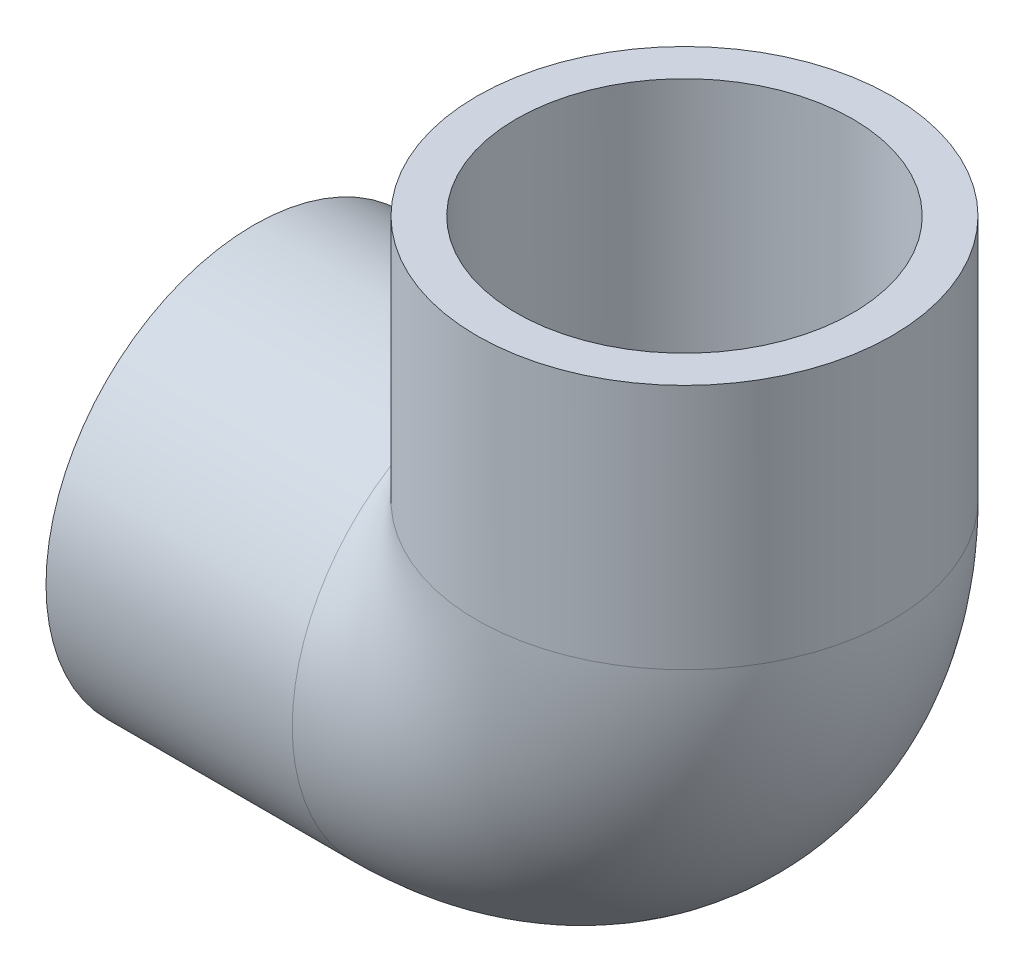
ISO-10303-21;
HEADER;
FILE_DESCRIPTION(('STEP AP214'),'2;1');
FILE_NAME('part.step','',(''),(''),'','','');
FILE_SCHEMA(('AUTOMOTIVE_DESIGN { 1 0 10303 214 1 1 1 1 }'));
ENDSEC;
DATA;
#1=APPLICATION_CONTEXT('core data for automotive mechanical design processes');
#2=APPLICATION_PROTOCOL_DEFINITION('international standard','automotive_design',2000,#1);
#3=PRODUCT_CONTEXT('',#1,'mechanical');
#4=PRODUCT('Part','Part','',(#3));
#5=PRODUCT_RELATED_PRODUCT_CATEGORY('part','',(#4));
#6=PRODUCT_DEFINITION_FORMATION('','',#4);
#7=PRODUCT_DEFINITION_CONTEXT('part definition',#1,'design');
#8=PRODUCT_DEFINITION('design','',#6,#7);
#9=PRODUCT_DEFINITION_SHAPE('','',#8);
#10=(LENGTH_UNIT() NAMED_UNIT(*) SI_UNIT(.MILLI.,.METRE.));
#11=(NAMED_UNIT(*) PLANE_ANGLE_UNIT() SI_UNIT($,.RADIAN.));
#12=(NAMED_UNIT(*) SI_UNIT($,.STERADIAN.) SOLID_ANGLE_UNIT());
#13=UNCERTAINTY_MEASURE_WITH_UNIT(LENGTH_MEASURE(1.E-05),#10,'distance_accuracy_value','');
#14=(GEOMETRIC_REPRESENTATION_CONTEXT(3) GLOBAL_UNCERTAINTY_ASSIGNED_CONTEXT((#13)) GLOBAL_UNIT_ASSIGNED_CONTEXT((#10,
#11,#12)) REPRESENTATION_CONTEXT('',''));
#15=CARTESIAN_POINT('',(0.,0.,0.));
#16=DIRECTION('',(0.,0.,1.));
#17=DIRECTION('',(1.,0.,0.));
#18=AXIS2_PLACEMENT_3D('',#15,#16,#17);
#19=CARTESIAN_POINT('',(-62.23,-29.972,0.));
#20=DIRECTION('',(-1.,0.,0.));
#21=DIRECTION('',(0.,0.,1.));
#22=AXIS2_PLACEMENT_3D('',#19,#20,#21);
#23=PLANE('',#22);
#24=CARTESIAN_POINT('',(-62.23,0.,0.));
#25=DIRECTION('',(-1.,0.,0.));
#26=DIRECTION('',(0.,0.,1.));
#27=AXIS2_PLACEMENT_3D('',#24,#25,#26);
#28=CIRCLE('',#27,29.972);
#29=CARTESIAN_POINT('',(-62.23,0.,29.972));
#30=VERTEX_POINT('',#29);
#31=EDGE_CURVE('E54',#30,#30,#28,.T.);
#32=ORIENTED_EDGE('',*,*,#31,.T.);
#33=EDGE_LOOP('',(#32));
#34=FACE_BOUND('',#33,.T.);
#35=CARTESIAN_POINT('',(-62.23,0.,0.));
#36=DIRECTION('',(-1.,0.,0.));
#37=DIRECTION('',(0.,0.,1.));
#38=AXIS2_PLACEMENT_3D('',#35,#36,#37);
#39=CIRCLE('',#38,24.2824);
#40=CARTESIAN_POINT('',(-62.23,0.,24.2824));
#41=VERTEX_POINT('',#40);
#42=EDGE_CURVE('E41',#41,#41,#39,.T.);
#43=ORIENTED_EDGE('',*,*,#42,.F.);
#44=EDGE_LOOP('',(#43));
#45=FACE_BOUND('',#44,.T.);
#46=ADVANCED_FACE('F34',(#34,#45),#23,.T.);
#47=CARTESIAN_POINT('',(-26.67,0.,0.));
#48=DIRECTION('',(-1.,0.,0.));
#49=DIRECTION('',(0.,0.,1.));
#50=AXIS2_PLACEMENT_3D('',#47,#48,#49);
#51=CONICAL_SURFACE('',#50,24.0538,0.00642848287391597);
#52=ORIENTED_EDGE('',*,*,#42,.T.);
#53=EDGE_LOOP('',(#52));
#54=FACE_BOUND('',#53,.T.);
#55=CARTESIAN_POINT('',(-26.67,0.,0.));
#56=DIRECTION('',(-1.,0.,0.));
#57=DIRECTION('',(0.,0.,1.));
#58=AXIS2_PLACEMENT_3D('',#55,#56,#57);
#59=CIRCLE('',#58,24.0538);
#60=CARTESIAN_POINT('',(-26.67,0.,24.0538));
#61=VERTEX_POINT('',#60);
#62=EDGE_CURVE('E65',#61,#61,#59,.T.);
#63=ORIENTED_EDGE('',*,*,#62,.F.);
#64=EDGE_LOOP('',(#63));
#65=FACE_BOUND('',#64,.T.);
#66=ADVANCED_FACE('F74',(#54,#65),#51,.F.);
#67=CARTESIAN_POINT('',(-62.23,0.,0.));
#68=DIRECTION('',(-1.,0.,0.));
#69=DIRECTION('',(0.,0.,1.));
#70=AXIS2_PLACEMENT_3D('',#67,#68,#69);
#71=CYLINDRICAL_SURFACE('',#70,29.972);
#72=CARTESIAN_POINT('',(0.,0.,0.));
#73=DIRECTION('',(-0.707106781186547,-0.707106781186547,0.));
#74=DIRECTION('',(-0.707106781186547,0.707106781186547,0.));
#75=AXIS2_PLACEMENT_3D('',#72,#73,#74);
#76=ELLIPSE('',#75,42.3868088914464,29.972);
#77=CARTESIAN_POINT('',(-26.67,26.67,-13.6759600759873));
#78=VERTEX_POINT('',#77);
#79=CARTESIAN_POINT('',(-26.67,26.67,13.6759600759873));
#80=VERTEX_POINT('',#79);
#81=EDGE_CURVE('E53',#78,#80,#76,.F.);
#82=ORIENTED_EDGE('',*,*,#81,.F.);
#83=CARTESIAN_POINT('',(-26.67,0.,0.));
#84=DIRECTION('',(-1.,0.,0.));
#85=DIRECTION('',(0.,0.,1.));
#86=AXIS2_PLACEMENT_3D('',#83,#84,#85);
#87=CIRCLE('',#86,29.972);
#88=EDGE_CURVE('E60',#78,#80,#87,.T.);
#89=ORIENTED_EDGE('',*,*,#88,.T.);
#90=EDGE_LOOP('',(#82,#89));
#91=FACE_BOUND('',#90,.T.);
#92=ORIENTED_EDGE('',*,*,#31,.F.);
#93=EDGE_LOOP('',(#92));
#94=FACE_BOUND('',#93,.T.);
#95=ADVANCED_FACE('F58',(#91,#94),#71,.T.);
#96=CARTESIAN_POINT('',(-26.67,26.67,0.));
#97=DIRECTION('',(0.,0.,-1.));
#98=DIRECTION('',(-1.,0.,0.));
#99=AXIS2_PLACEMENT_3D('',#96,#97,#98);
#100=TOROIDAL_SURFACE('',#99,26.67,19.05);
#101=CARTESIAN_POINT('',(0.,26.67,0.));
#102=DIRECTION('',(0.,1.,0.));
#103=DIRECTION('',(0.,0.,-1.));
#104=AXIS2_PLACEMENT_3D('',#101,#102,#103);
#105=CIRCLE('',#104,19.05);
#106=CARTESIAN_POINT('',(19.05,26.67,0.));
#107=VERTEX_POINT('',#106);
#108=EDGE_CURVE('E55',#107,#107,#105,.T.);
#109=CARTESIAN_POINT('',(-26.67,0.,0.));
#110=DIRECTION('',(1.,0.,0.));
#111=DIRECTION('',(0.,0.,-1.));
#112=AXIS2_PLACEMENT_3D('',#109,#110,#111);
#113=CIRCLE('',#112,19.05);
#114=CARTESIAN_POINT('',(-26.67,-19.05,0.));
#115=VERTEX_POINT('',#114);
#116=EDGE_CURVE('E61',#115,#115,#113,.T.);
#117=CARTESIAN_POINT('',(-26.67,26.67,0.));
#118=DIRECTION('',(0.,0.,-1.));
#119=DIRECTION('',(-1.,0.,0.));
#120=AXIS2_PLACEMENT_3D('',#117,#118,#119);
#121=CIRCLE('',#120,45.72);
#122=EDGE_CURVE('',#107,#115,#121,.T.);
#123=ORIENTED_EDGE('',*,*,#108,.T.);
#124=ORIENTED_EDGE('',*,*,#116,.F.);
#125=ORIENTED_EDGE('',*,*,#122,.T.);
#126=ORIENTED_EDGE('',*,*,#122,.F.);
#127=EDGE_LOOP('',(#123,#125,#124,#126));
#128=FACE_BOUND('',#127,.T.);
#129=ADVANCED_FACE('F84',(#128),#100,.F.);
#130=CARTESIAN_POINT('',(-53.34,26.67,0.));
#131=DIRECTION('',(0.,-1.,0.));
#132=DIRECTION('',(-1.,0.,0.));
#133=AXIS2_PLACEMENT_3D('',#130,#131,#132);
#134=CIRCLE('',#133,29.972);
#135=TRIMMED_CURVE('',#134,(PARAMETER_VALUE(-2.66776990694721)),
(PARAMETER_VALUE(2.66776990694721)),.T.,.PARAMETER.);
#136=CARTESIAN_POINT('',(-26.67,26.67,0.));
#137=DIRECTION('',(0.,0.,-1.));
#138=AXIS1_PLACEMENT('',#136,#137);
#139=SURFACE_OF_REVOLUTION('',#135,#138);
#140=CARTESIAN_POINT('',(0.,26.67,0.));
#141=DIRECTION('',(0.,1.,0.));
#142=DIRECTION('',(0.,0.,-1.));
#143=AXIS2_PLACEMENT_3D('',#140,#141,#142);
#144=CIRCLE('',#143,29.972);
#145=EDGE_CURVE('E47',#80,#78,#144,.T.);
#146=ORIENTED_EDGE('',*,*,#145,.F.);
#147=ORIENTED_EDGE('',*,*,#88,.F.);
#148=EDGE_LOOP('',(#146,#147));
#149=FACE_BOUND('',#148,.T.);
#150=ADVANCED_FACE('F64',(#149),#139,.T.);
#151=CARTESIAN_POINT('',(0.,26.67,0.));
#152=DIRECTION('',(0.,1.,0.));
#153=DIRECTION('',(0.,0.,-1.));
#154=AXIS2_PLACEMENT_3D('',#151,#152,#153);
#155=PLANE('',#154);
#156=CARTESIAN_POINT('',(0.,26.67,0.));
#157=DIRECTION('',(0.,1.,0.));
#158=DIRECTION('',(-1.,0.,0.));
#159=AXIS2_PLACEMENT_3D('',#156,#157,#158);
#160=CIRCLE('',#159,24.0538);
#161=CARTESIAN_POINT('',(-24.0538,26.67,0.));
#162=VERTEX_POINT('',#161);
#163=EDGE_CURVE('E11',#162,#162,#160,.F.);
#164=ORIENTED_EDGE('',*,*,#163,.F.);
#165=EDGE_LOOP('',(#164));
#166=FACE_BOUND('',#165,.T.);
#167=ORIENTED_EDGE('',*,*,#108,.F.);
#168=EDGE_LOOP('',(#167));
#169=FACE_BOUND('',#168,.T.);
#170=ADVANCED_FACE('F91',(#166,#169),#155,.T.);
#171=CARTESIAN_POINT('',(-26.67,0.,0.));
#172=DIRECTION('',(1.,0.,0.));
#173=DIRECTION('',(0.,0.,-1.));
#174=AXIS2_PLACEMENT_3D('',#171,#172,#173);
#175=PLANE('',#174);
#176=ORIENTED_EDGE('',*,*,#62,.T.);
#177=EDGE_LOOP('',(#176));
#178=FACE_BOUND('',#177,.T.);
#179=ORIENTED_EDGE('',*,*,#116,.T.);
#180=EDGE_LOOP('',(#179));
#181=FACE_BOUND('',#180,.T.);
#182=ADVANCED_FACE('F94',(#178,#181),#175,.F.);
#183=CARTESIAN_POINT('',(29.972,62.23,0.));
#184=DIRECTION('',(0.,1.,0.));
#185=DIRECTION('',(0.,0.,1.));
#186=AXIS2_PLACEMENT_3D('',#183,#184,#185);
#187=PLANE('',#186);
#188=CARTESIAN_POINT('',(0.,62.23,0.));
#189=DIRECTION('',(0.,-1.,0.));
#190=DIRECTION('',(0.,0.,-1.));
#191=AXIS2_PLACEMENT_3D('',#188,#189,#190);
#192=CIRCLE('',#191,24.2824);
#193=CARTESIAN_POINT('',(0.,62.23,-24.2824));
#194=VERTEX_POINT('',#193);
#195=EDGE_CURVE('E118',#194,#194,#192,.T.);
#196=ORIENTED_EDGE('',*,*,#195,.T.);
#197=EDGE_LOOP('',(#196));
#198=FACE_BOUND('',#197,.T.);
#199=CARTESIAN_POINT('',(0.,62.23,0.));
#200=DIRECTION('',(0.,-1.,0.));
#201=DIRECTION('',(0.,0.,-1.));
#202=AXIS2_PLACEMENT_3D('',#199,#200,#201);
#203=CIRCLE('',#202,29.972);
#204=CARTESIAN_POINT('',(0.,62.23,-29.972));
#205=VERTEX_POINT('',#204);
#206=EDGE_CURVE('E62',#205,#205,#203,.T.);
#207=ORIENTED_EDGE('',*,*,#206,.F.);
#208=EDGE_LOOP('',(#207));
#209=FACE_BOUND('',#208,.T.);
#210=ADVANCED_FACE('F101',(#198,#209),#187,.T.);
#211=CARTESIAN_POINT('',(0.,0.,0.));
#212=DIRECTION('',(0.,-1.,0.));
#213=DIRECTION('',(0.,0.,-1.));
#214=AXIS2_PLACEMENT_3D('',#211,#212,#213);
#215=CYLINDRICAL_SURFACE('',#214,29.972);
#216=ORIENTED_EDGE('',*,*,#206,.T.);
#217=EDGE_LOOP('',(#216));
#218=FACE_BOUND('',#217,.T.);
#219=ORIENTED_EDGE('',*,*,#145,.T.);
#220=ORIENTED_EDGE('',*,*,#81,.T.);
#221=EDGE_LOOP('',(#219,#220));
#222=FACE_BOUND('',#221,.T.);
#223=ADVANCED_FACE('F52',(#218,#222),#215,.T.);
#224=CARTESIAN_POINT('',(0.,62.23,0.));
#225=DIRECTION('',(0.,1.,0.));
#226=DIRECTION('',(0.,0.,1.));
#227=AXIS2_PLACEMENT_3D('',#224,#225,#226);
#228=CONICAL_SURFACE('',#227,24.2824,0.00642848287391597);
#229=ORIENTED_EDGE('',*,*,#163,.T.);
#230=EDGE_LOOP('',(#229));
#231=FACE_BOUND('',#230,.T.);
#232=ORIENTED_EDGE('',*,*,#195,.F.);
#233=EDGE_LOOP('',(#232));
#234=FACE_BOUND('',#233,.T.);
#235=ADVANCED_FACE('F108',(#231,#234),#228,.F.);
#236=CLOSED_SHELL('',(#46,#66,#95,#129,#150,#170,#182,#210,#223,#235));
#237=MANIFOLD_SOLID_BREP('B2',#236);
#238=ADVANCED_BREP_SHAPE_REPRESENTATION('',(#18,#237),#14);
#239=SHAPE_DEFINITION_REPRESENTATION(#9,#238);
ENDSEC;
END-ISO-10303-21;
